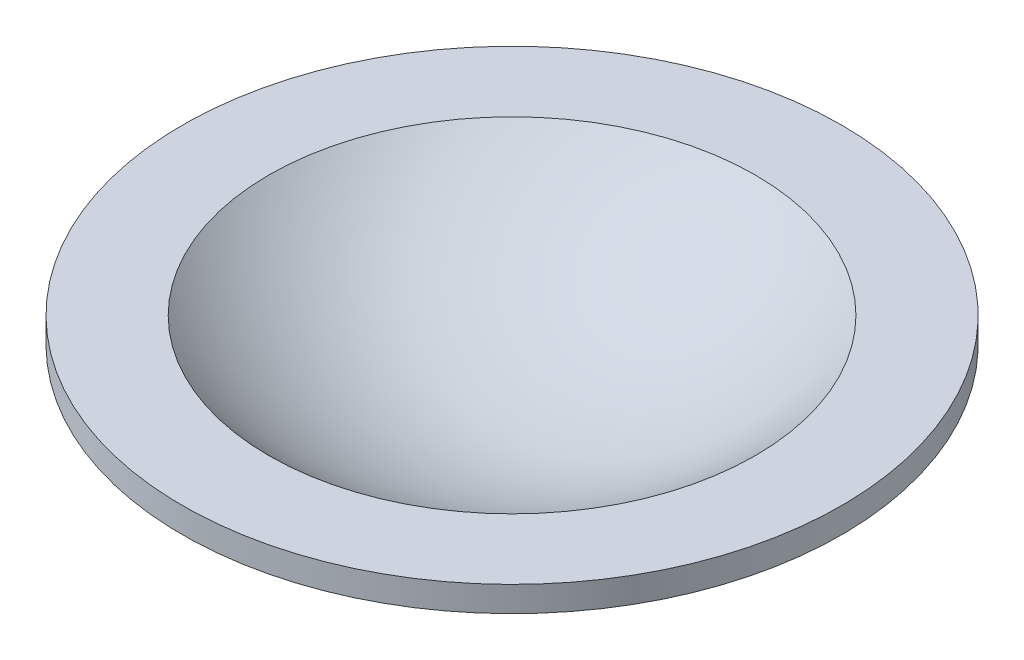
ISO-10303-21;
HEADER;
FILE_DESCRIPTION(('STEP AP214'),'2;1');
FILE_NAME('part.step','',(''),(''),'','','');
FILE_SCHEMA(('AUTOMOTIVE_DESIGN { 1 0 10303 214 1 1 1 1 }'));
ENDSEC;
DATA;
#1=APPLICATION_CONTEXT('core data for automotive mechanical design processes');
#2=APPLICATION_PROTOCOL_DEFINITION('international standard','automotive_design',2000,#1);
#3=PRODUCT_CONTEXT('',#1,'mechanical');
#4=PRODUCT('Part','Part','',(#3));
#5=PRODUCT_RELATED_PRODUCT_CATEGORY('part','',(#4));
#6=PRODUCT_DEFINITION_FORMATION('','',#4);
#7=PRODUCT_DEFINITION_CONTEXT('part definition',#1,'design');
#8=PRODUCT_DEFINITION('design','',#6,#7);
#9=PRODUCT_DEFINITION_SHAPE('','',#8);
#10=(LENGTH_UNIT() NAMED_UNIT(*) SI_UNIT(.MILLI.,.METRE.));
#11=(NAMED_UNIT(*) PLANE_ANGLE_UNIT() SI_UNIT($,.RADIAN.));
#12=(NAMED_UNIT(*) SI_UNIT($,.STERADIAN.) SOLID_ANGLE_UNIT());
#13=UNCERTAINTY_MEASURE_WITH_UNIT(LENGTH_MEASURE(1.E-05),#10,'distance_accuracy_value','');
#14=(GEOMETRIC_REPRESENTATION_CONTEXT(3) GLOBAL_UNCERTAINTY_ASSIGNED_CONTEXT((#13)) GLOBAL_UNIT_ASSIGNED_CONTEXT((#10,
#11,#12)) REPRESENTATION_CONTEXT('',''));
#15=CARTESIAN_POINT('',(0.,0.,0.));
#16=DIRECTION('',(0.,0.,1.));
#17=DIRECTION('',(1.,0.,0.));
#18=AXIS2_PLACEMENT_3D('',#15,#16,#17);
#19=CARTESIAN_POINT('',(0.,7.25,0.));
#20=DIRECTION('',(0.,-1.,0.));
#21=DIRECTION('',(1.,0.,0.));
#22=AXIS2_PLACEMENT_3D('',#19,#20,#21);
#23=SPHERICAL_SURFACE('',#22,6.75);
#24=CARTESIAN_POINT('',(0.,2.5,0.));
#25=DIRECTION('',(0.,-1.,0.));
#26=DIRECTION('',(0.,0.,-1.));
#27=AXIS2_PLACEMENT_3D('',#24,#25,#26);
#28=CIRCLE('',#27,4.79583152331272);
#29=CARTESIAN_POINT('',(0.,2.5,-4.79583152331272));
#30=VERTEX_POINT('',#29);
#31=EDGE_CURVE('E28',#30,#30,#28,.T.);
#32=ORIENTED_EDGE('',*,*,#31,.F.);
#33=EDGE_LOOP('',(#32));
#34=FACE_BOUND('',#33,.T.);
#35=ADVANCED_FACE('F14',(#34),#23,.F.);
#36=CARTESIAN_POINT('',(0.,7.25,0.));
#37=DIRECTION('',(0.,-1.,0.));
#38=DIRECTION('',(1.,0.,0.));
#39=AXIS2_PLACEMENT_3D('',#36,#37,#38);
#40=SPHERICAL_SURFACE('',#39,7.25);
#41=CARTESIAN_POINT('',(0.,2.,0.));
#42=DIRECTION('',(0.,-1.,0.));
#43=DIRECTION('',(0.,0.,-1.));
#44=AXIS2_PLACEMENT_3D('',#41,#42,#43);
#45=CIRCLE('',#44,5.);
#46=CARTESIAN_POINT('',(0.,2.,-5.));
#47=VERTEX_POINT('',#46);
#48=EDGE_CURVE('E10',#47,#47,#45,.T.);
#49=ORIENTED_EDGE('',*,*,#48,.T.);
#50=EDGE_LOOP('',(#49));
#51=FACE_BOUND('',#50,.T.);
#52=ADVANCED_FACE('F38',(#51),#40,.T.);
#53=CARTESIAN_POINT('',(6.5,2.,0.));
#54=DIRECTION('',(0.,1.,0.));
#55=DIRECTION('',(0.,0.,1.));
#56=AXIS2_PLACEMENT_3D('',#53,#54,#55);
#57=PLANE('',#56);
#58=ORIENTED_EDGE('',*,*,#48,.F.);
#59=EDGE_LOOP('',(#58));
#60=FACE_BOUND('',#59,.T.);
#61=CARTESIAN_POINT('',(0.,2.,0.));
#62=DIRECTION('',(0.,-1.,0.));
#63=DIRECTION('',(0.,0.,-1.));
#64=AXIS2_PLACEMENT_3D('',#61,#62,#63);
#65=CIRCLE('',#64,6.5);
#66=CARTESIAN_POINT('',(0.,2.,-6.5));
#67=VERTEX_POINT('',#66);
#68=EDGE_CURVE('E20',#67,#67,#65,.T.);
#69=ORIENTED_EDGE('',*,*,#68,.T.);
#70=EDGE_LOOP('',(#69));
#71=FACE_BOUND('',#70,.T.);
#72=ADVANCED_FACE('F43',(#60,#71),#57,.F.);
#73=CARTESIAN_POINT('',(0.,0.,0.));
#74=DIRECTION('',(0.,-1.,0.));
#75=DIRECTION('',(0.,0.,-1.));
#76=AXIS2_PLACEMENT_3D('',#73,#74,#75);
#77=CYLINDRICAL_SURFACE('',#76,6.5);
#78=ORIENTED_EDGE('',*,*,#68,.F.);
#79=EDGE_LOOP('',(#78));
#80=FACE_BOUND('',#79,.T.);
#81=CARTESIAN_POINT('',(0.,2.5,0.));
#82=DIRECTION('',(0.,-1.,0.));
#83=DIRECTION('',(0.,0.,-1.));
#84=AXIS2_PLACEMENT_3D('',#81,#82,#83);
#85=CIRCLE('',#84,6.5);
#86=CARTESIAN_POINT('',(0.,2.5,-6.5));
#87=VERTEX_POINT('',#86);
#88=EDGE_CURVE('E24',#87,#87,#85,.T.);
#89=ORIENTED_EDGE('',*,*,#88,.T.);
#90=EDGE_LOOP('',(#89));
#91=FACE_BOUND('',#90,.T.);
#92=ADVANCED_FACE('F47',(#80,#91),#77,.T.);
#93=CARTESIAN_POINT('',(6.5,2.5,0.));
#94=DIRECTION('',(0.,1.,0.));
#95=DIRECTION('',(0.,0.,1.));
#96=AXIS2_PLACEMENT_3D('',#93,#94,#95);
#97=PLANE('',#96);
#98=ORIENTED_EDGE('',*,*,#31,.T.);
#99=EDGE_LOOP('',(#98));
#100=FACE_BOUND('',#99,.T.);
#101=ORIENTED_EDGE('',*,*,#88,.F.);
#102=EDGE_LOOP('',(#101));
#103=FACE_BOUND('',#102,.T.);
#104=ADVANCED_FACE('F34',(#100,#103),#97,.T.);
#105=CLOSED_SHELL('',(#35,#52,#72,#92,#104));
#106=MANIFOLD_SOLID_BREP('B1',#105);
#107=ADVANCED_BREP_SHAPE_REPRESENTATION('',(#18,#106),#14);
#108=SHAPE_DEFINITION_REPRESENTATION(#9,#107);
ENDSEC;
END-ISO-10303-21;
